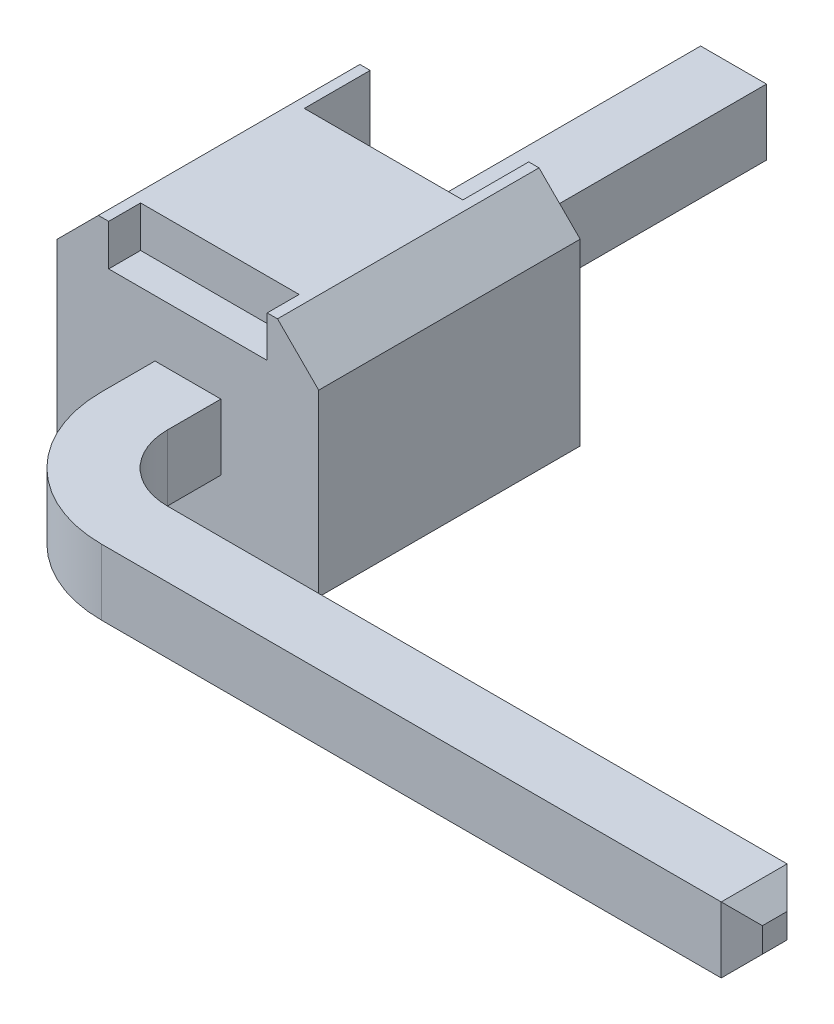
ISO-10303-21;
HEADER;
FILE_DESCRIPTION(('STEP AP214'),'2;1');
FILE_NAME('part.step','',(''),(''),'','','');
FILE_SCHEMA(('AUTOMOTIVE_DESIGN { 1 0 10303 214 1 1 1 1 }'));
ENDSEC;
DATA;
#1=APPLICATION_CONTEXT('core data for automotive mechanical design processes');
#2=APPLICATION_PROTOCOL_DEFINITION('international standard','automotive_design',2000,#1);
#3=PRODUCT_CONTEXT('',#1,'mechanical');
#4=PRODUCT('Part','Part','',(#3));
#5=PRODUCT_RELATED_PRODUCT_CATEGORY('part','',(#4));
#6=PRODUCT_DEFINITION_FORMATION('','',#4);
#7=PRODUCT_DEFINITION_CONTEXT('part definition',#1,'design');
#8=PRODUCT_DEFINITION('design','',#6,#7);
#9=PRODUCT_DEFINITION_SHAPE('','',#8);
#10=(LENGTH_UNIT() NAMED_UNIT(*) SI_UNIT(.MILLI.,.METRE.));
#11=(NAMED_UNIT(*) PLANE_ANGLE_UNIT() SI_UNIT($,.RADIAN.));
#12=(NAMED_UNIT(*) SI_UNIT($,.STERADIAN.) SOLID_ANGLE_UNIT());
#13=UNCERTAINTY_MEASURE_WITH_UNIT(LENGTH_MEASURE(1.E-05),#10,'distance_accuracy_value','');
#14=(GEOMETRIC_REPRESENTATION_CONTEXT(3) GLOBAL_UNCERTAINTY_ASSIGNED_CONTEXT((#13)) GLOBAL_UNIT_ASSIGNED_CONTEXT((#10,
#11,#12)) REPRESENTATION_CONTEXT('',''));
#15=CARTESIAN_POINT('',(0.,0.,0.));
#16=DIRECTION('',(0.,0.,1.));
#17=DIRECTION('',(1.,0.,0.));
#18=AXIS2_PLACEMENT_3D('',#15,#16,#17);
#19=CARTESIAN_POINT('',(1.27,1.27,2.96));
#20=DIRECTION('',(0.,0.,-1.));
#21=DIRECTION('',(0.,-1.,0.));
#22=AXIS2_PLACEMENT_3D('',#19,#20,#21);
#23=PLANE('',#22);
#24=DIRECTION('',(0.,-1.,0.));
#25=VECTOR('',#24,1.);
#26=CARTESIAN_POINT('',(1.27,1.27,2.96));
#27=LINE('',#26,#25);
#28=CARTESIAN_POINT('',(1.27,0.87,2.96));
#29=VERTEX_POINT('',#28);
#30=CARTESIAN_POINT('',(1.27,-0.87,2.96));
#31=VERTEX_POINT('',#30);
#32=EDGE_CURVE('P0_E199',#29,#31,#27,.T.);
#33=ORIENTED_EDGE('',*,*,#32,.T.);
#34=DIRECTION('',(-0.707106781186548,-0.707106781186548,0.));
#35=VECTOR('',#34,1.);
#36=CARTESIAN_POINT('',(1.705,-0.435,2.96));
#37=LINE('',#36,#35);
#38=CARTESIAN_POINT('',(0.87,-1.27,2.96));
#39=VERTEX_POINT('',#38);
#40=EDGE_CURVE('P0_E193',#31,#39,#37,.T.);
#41=ORIENTED_EDGE('',*,*,#40,.T.);
#42=DIRECTION('',(-1.,0.,0.));
#43=VECTOR('',#42,1.);
#44=CARTESIAN_POINT('',(1.27,-1.27,2.96));
#45=LINE('',#44,#43);
#46=CARTESIAN_POINT('',(0.77,-1.27,2.96));
#47=VERTEX_POINT('',#46);
#48=EDGE_CURVE('P0_E196',#39,#47,#45,.T.);
#49=ORIENTED_EDGE('',*,*,#48,.T.);
#50=DIRECTION('',(0.,-1.,0.));
#51=VECTOR('',#50,1.);
#52=CARTESIAN_POINT('',(0.77,1.27,2.96));
#53=LINE('',#52,#51);
#54=CARTESIAN_POINT('',(0.77,1.27,2.96));
#55=VERTEX_POINT('',#54);
#56=EDGE_CURVE('P0_E11',#55,#47,#53,.T.);
#57=ORIENTED_EDGE('',*,*,#56,.F.);
#58=DIRECTION('',(-1.,0.,0.));
#59=VECTOR('',#58,1.);
#60=CARTESIAN_POINT('',(1.27,1.27,2.96));
#61=LINE('',#60,#59);
#62=CARTESIAN_POINT('',(0.87,1.27,2.96));
#63=VERTEX_POINT('',#62);
#64=EDGE_CURVE('P0_E274',#63,#55,#61,.T.);
#65=ORIENTED_EDGE('',*,*,#64,.F.);
#66=DIRECTION('',(0.707106781186548,-0.707106781186548,0.));
#67=VECTOR('',#66,1.);
#68=CARTESIAN_POINT('',(1.07,1.07,2.96));
#69=LINE('',#68,#67);
#70=EDGE_CURVE('P0_E244',#63,#29,#69,.T.);
#71=ORIENTED_EDGE('',*,*,#70,.T.);
#72=EDGE_LOOP('',(#33,#41,#49,#57,#65,#71));
#73=FACE_BOUND('',#72,.T.);
#74=ADVANCED_FACE('P0_F16',(#73),#23,.T.);
#75=CARTESIAN_POINT('',(-0.77,0.87,5.19));
#76=DIRECTION('',(0.,0.,1.));
#77=DIRECTION('',(1.,0.,0.));
#78=AXIS2_PLACEMENT_3D('',#75,#76,#77);
#79=PLANE('',#78);
#80=DIRECTION('',(0.,1.,0.));
#81=VECTOR('',#80,1.);
#82=CARTESIAN_POINT('',(-0.77,0.87,5.19));
#83=LINE('',#82,#81);
#84=CARTESIAN_POINT('',(-0.77,0.87,5.19));
#85=VERTEX_POINT('',#84);
#86=CARTESIAN_POINT('',(-0.77,1.27,5.19));
#87=VERTEX_POINT('',#86);
#88=EDGE_CURVE('P0_E204',#85,#87,#83,.T.);
#89=ORIENTED_EDGE('',*,*,#88,.F.);
#90=DIRECTION('',(1.,0.,0.));
#91=VECTOR('',#90,1.);
#92=CARTESIAN_POINT('',(-0.77,0.87,5.19));
#93=LINE('',#92,#91);
#94=CARTESIAN_POINT('',(0.77,0.87,5.19));
#95=VERTEX_POINT('',#94);
#96=EDGE_CURVE('P0_E287',#85,#95,#93,.T.);
#97=ORIENTED_EDGE('',*,*,#96,.T.);
#98=DIRECTION('',(0.,1.,0.));
#99=VECTOR('',#98,1.);
#100=CARTESIAN_POINT('',(0.77,0.87,5.19));
#101=LINE('',#100,#99);
#102=CARTESIAN_POINT('',(0.77,1.27,5.19));
#103=VERTEX_POINT('',#102);
#104=EDGE_CURVE('P0_E242',#95,#103,#101,.T.);
#105=ORIENTED_EDGE('',*,*,#104,.T.);
#106=DIRECTION('',(1.,0.,0.));
#107=VECTOR('',#106,1.);
#108=CARTESIAN_POINT('',(-0.385,1.27,5.19));
#109=LINE('',#108,#107);
#110=EDGE_CURVE('P0_E309',#87,#103,#109,.T.);
#111=ORIENTED_EDGE('',*,*,#110,.F.);
#112=EDGE_LOOP('',(#89,#97,#105,#111));
#113=FACE_BOUND('',#112,.T.);
#114=ADVANCED_FACE('P0_F667',(#113),#79,.T.);
#115=CARTESIAN_POINT('',(0.77,1.27,2.96));
#116=DIRECTION('',(-1.,0.,0.));
#117=DIRECTION('',(0.,0.,1.));
#118=AXIS2_PLACEMENT_3D('',#115,#116,#117);
#119=PLANE('',#118);
#120=ORIENTED_EDGE('',*,*,#56,.T.);
#121=DIRECTION('',(0.,0.,1.));
#122=VECTOR('',#121,1.);
#123=CARTESIAN_POINT('',(0.77,-1.27,2.96));
#124=LINE('',#123,#122);
#125=CARTESIAN_POINT('',(0.77,-1.27,3.6));
#126=VERTEX_POINT('',#125);
#127=EDGE_CURVE('P0_E220',#47,#126,#124,.T.);
#128=ORIENTED_EDGE('',*,*,#127,.T.);
#129=DIRECTION('',(0.,-1.,0.));
#130=VECTOR('',#129,1.);
#131=CARTESIAN_POINT('',(0.77,1.27,3.6));
#132=LINE('',#131,#130);
#133=CARTESIAN_POINT('',(0.77,1.27,3.6));
#134=VERTEX_POINT('',#133);
#135=EDGE_CURVE('P0_E19',#134,#126,#132,.T.);
#136=ORIENTED_EDGE('',*,*,#135,.F.);
#137=DIRECTION('',(0.,0.,1.));
#138=VECTOR('',#137,1.);
#139=CARTESIAN_POINT('',(0.77,1.27,2.96));
#140=LINE('',#139,#138);
#141=EDGE_CURVE('P0_E301',#55,#134,#140,.T.);
#142=ORIENTED_EDGE('',*,*,#141,.F.);
#143=EDGE_LOOP('',(#120,#128,#136,#142));
#144=FACE_BOUND('',#143,.T.);
#145=ADVANCED_FACE('P0_F437',(#144),#119,.T.);
#146=CARTESIAN_POINT('',(0.77,1.27,3.6));
#147=DIRECTION('',(0.,0.,-1.));
#148=DIRECTION('',(0.,-1.,0.));
#149=AXIS2_PLACEMENT_3D('',#146,#147,#148);
#150=PLANE('',#149);
#151=DIRECTION('',(1.,0.,0.));
#152=VECTOR('',#151,1.);
#153=CARTESIAN_POINT('',(0.225,0.32,3.6));
#154=LINE('',#153,#152);
#155=CARTESIAN_POINT('',(-0.32,0.32,3.6));
#156=VERTEX_POINT('',#155);
#157=CARTESIAN_POINT('',(0.32,0.32,3.6));
#158=VERTEX_POINT('',#157);
#159=EDGE_CURVE('P0_E38',#156,#158,#154,.T.);
#160=ORIENTED_EDGE('',*,*,#159,.F.);
#161=DIRECTION('',(0.,-1.,0.));
#162=VECTOR('',#161,1.);
#163=CARTESIAN_POINT('',(-0.32,0.475,3.6));
#164=LINE('',#163,#162);
#165=CARTESIAN_POINT('',(-0.32,-0.32,3.6));
#166=VERTEX_POINT('',#165);
#167=EDGE_CURVE('P0_E310',#156,#166,#164,.T.);
#168=ORIENTED_EDGE('',*,*,#167,.T.);
#169=DIRECTION('',(1.,0.,0.));
#170=VECTOR('',#169,1.);
#171=CARTESIAN_POINT('',(0.225,-0.32,3.6));
#172=LINE('',#171,#170);
#173=CARTESIAN_POINT('',(0.32,-0.32,3.6));
#174=VERTEX_POINT('',#173);
#175=EDGE_CURVE('P0_E334',#166,#174,#172,.T.);
#176=ORIENTED_EDGE('',*,*,#175,.T.);
#177=DIRECTION('',(0.,-1.,0.));
#178=VECTOR('',#177,1.);
#179=CARTESIAN_POINT('',(0.32,0.475,3.6));
#180=LINE('',#179,#178);
#181=EDGE_CURVE('P0_E314',#158,#174,#180,.T.);
#182=ORIENTED_EDGE('',*,*,#181,.F.);
#183=EDGE_LOOP('',(#160,#168,#176,#182));
#184=FACE_BOUND('',#183,.T.);
#185=ORIENTED_EDGE('',*,*,#135,.T.);
#186=DIRECTION('',(-1.,0.,0.));
#187=VECTOR('',#186,1.);
#188=CARTESIAN_POINT('',(0.77,-1.27,3.6));
#189=LINE('',#188,#187);
#190=CARTESIAN_POINT('',(-0.77,-1.27,3.6));
#191=VERTEX_POINT('',#190);
#192=EDGE_CURVE('P0_E227',#126,#191,#189,.T.);
#193=ORIENTED_EDGE('',*,*,#192,.T.);
#194=DIRECTION('',(0.,-1.,0.));
#195=VECTOR('',#194,1.);
#196=CARTESIAN_POINT('',(-0.77,1.27,3.6));
#197=LINE('',#196,#195);
#198=CARTESIAN_POINT('',(-0.77,1.27,3.6));
#199=VERTEX_POINT('',#198);
#200=EDGE_CURVE('P0_E238',#199,#191,#197,.T.);
#201=ORIENTED_EDGE('',*,*,#200,.F.);
#202=DIRECTION('',(-1.,0.,0.));
#203=VECTOR('',#202,1.);
#204=CARTESIAN_POINT('',(0.77,1.27,3.6));
#205=LINE('',#204,#203);
#206=EDGE_CURVE('P0_E297',#134,#199,#205,.T.);
#207=ORIENTED_EDGE('',*,*,#206,.F.);
#208=EDGE_LOOP('',(#185,#193,#201,#207));
#209=FACE_BOUND('',#208,.T.);
#210=ADVANCED_FACE('P0_F433',(#184,#209),#150,.T.);
#211=CARTESIAN_POINT('',(-0.77,1.27,3.6));
#212=DIRECTION('',(1.,0.,0.));
#213=DIRECTION('',(0.,1.,0.));
#214=AXIS2_PLACEMENT_3D('',#211,#212,#213);
#215=PLANE('',#214);
#216=ORIENTED_EDGE('',*,*,#200,.T.);
#217=DIRECTION('',(0.,0.,-1.));
#218=VECTOR('',#217,1.);
#219=CARTESIAN_POINT('',(-0.77,-1.27,3.6));
#220=LINE('',#219,#218);
#221=CARTESIAN_POINT('',(-0.77,-1.27,2.96));
#222=VERTEX_POINT('',#221);
#223=EDGE_CURVE('P0_E326',#191,#222,#220,.T.);
#224=ORIENTED_EDGE('',*,*,#223,.T.);
#225=DIRECTION('',(0.,-1.,0.));
#226=VECTOR('',#225,1.);
#227=CARTESIAN_POINT('',(-0.77,1.27,2.96));
#228=LINE('',#227,#226);
#229=CARTESIAN_POINT('',(-0.77,1.27,2.96));
#230=VERTEX_POINT('',#229);
#231=EDGE_CURVE('P0_E241',#230,#222,#228,.T.);
#232=ORIENTED_EDGE('',*,*,#231,.F.);
#233=DIRECTION('',(0.,0.,-1.));
#234=VECTOR('',#233,1.);
#235=CARTESIAN_POINT('',(-0.77,1.27,3.6));
#236=LINE('',#235,#234);
#237=EDGE_CURVE('P0_E231',#199,#230,#236,.T.);
#238=ORIENTED_EDGE('',*,*,#237,.F.);
#239=EDGE_LOOP('',(#216,#224,#232,#238));
#240=FACE_BOUND('',#239,.T.);
#241=ADVANCED_FACE('P0_F436',(#240),#215,.T.);
#242=CARTESIAN_POINT('',(-0.77,1.27,2.96));
#243=DIRECTION('',(0.,0.,-1.));
#244=DIRECTION('',(0.,-1.,0.));
#245=AXIS2_PLACEMENT_3D('',#242,#243,#244);
#246=PLANE('',#245);
#247=DIRECTION('',(0.,-1.,0.));
#248=VECTOR('',#247,1.);
#249=CARTESIAN_POINT('',(-1.27,1.27,2.96));
#250=LINE('',#249,#248);
#251=CARTESIAN_POINT('',(-1.27,0.87,2.96));
#252=VERTEX_POINT('',#251);
#253=CARTESIAN_POINT('',(-1.27,-0.87,2.96));
#254=VERTEX_POINT('',#253);
#255=EDGE_CURVE('P0_E305',#252,#254,#250,.T.);
#256=ORIENTED_EDGE('',*,*,#255,.F.);
#257=DIRECTION('',(0.707106781186548,0.707106781186548,0.));
#258=VECTOR('',#257,1.);
#259=CARTESIAN_POINT('',(-0.945,1.195,2.96));
#260=LINE('',#259,#258);
#261=CARTESIAN_POINT('',(-0.87,1.27,2.96));
#262=VERTEX_POINT('',#261);
#263=EDGE_CURVE('P0_E255',#252,#262,#260,.T.);
#264=ORIENTED_EDGE('',*,*,#263,.T.);
#265=DIRECTION('',(-1.,0.,0.));
#266=VECTOR('',#265,1.);
#267=CARTESIAN_POINT('',(-0.77,1.27,2.96));
#268=LINE('',#267,#266);
#269=EDGE_CURVE('P0_E233',#230,#262,#268,.T.);
#270=ORIENTED_EDGE('',*,*,#269,.F.);
#271=ORIENTED_EDGE('',*,*,#231,.T.);
#272=DIRECTION('',(-1.,0.,0.));
#273=VECTOR('',#272,1.);
#274=CARTESIAN_POINT('',(-0.77,-1.27,2.96));
#275=LINE('',#274,#273);
#276=CARTESIAN_POINT('',(-0.87,-1.27,2.96));
#277=VERTEX_POINT('',#276);
#278=EDGE_CURVE('P0_E330',#222,#277,#275,.T.);
#279=ORIENTED_EDGE('',*,*,#278,.T.);
#280=DIRECTION('',(-0.707106781186548,0.707106781186548,0.));
#281=VECTOR('',#280,1.);
#282=CARTESIAN_POINT('',(-1.58,-0.56,2.96));
#283=LINE('',#282,#281);
#284=EDGE_CURVE('P0_E283',#277,#254,#283,.T.);
#285=ORIENTED_EDGE('',*,*,#284,.T.);
#286=EDGE_LOOP('',(#256,#264,#270,#271,#279,#285));
#287=FACE_BOUND('',#286,.T.);
#288=ADVANCED_FACE('P0_F679',(#287),#246,.T.);
#289=CARTESIAN_POINT('',(-0.32,0.32,0.));
#290=DIRECTION('',(0.,1.,0.));
#291=DIRECTION('',(1.,0.,0.));
#292=AXIS2_PLACEMENT_3D('',#289,#290,#291);
#293=PLANE('',#292);
#294=DIRECTION('',(0.,0.,1.));
#295=VECTOR('',#294,1.);
#296=CARTESIAN_POINT('',(0.32,0.32,0.));
#297=LINE('',#296,#295);
#298=CARTESIAN_POINT('',(0.32,0.32,5.5));
#299=VERTEX_POINT('',#298);
#300=EDGE_CURVE('P0_E377',#158,#299,#297,.T.);
#301=ORIENTED_EDGE('',*,*,#300,.T.);
#302=DIRECTION('',(-1.,0.,0.));
#303=VECTOR('',#302,1.);
#304=CARTESIAN_POINT('',(-0.795,0.32,5.5));
#305=LINE('',#304,#303);
#306=CARTESIAN_POINT('',(-0.32,0.32,5.5));
#307=VERTEX_POINT('',#306);
#308=EDGE_CURVE('P0_E291',#299,#307,#305,.T.);
#309=ORIENTED_EDGE('',*,*,#308,.T.);
#310=DIRECTION('',(0.,0.,1.));
#311=VECTOR('',#310,1.);
#312=CARTESIAN_POINT('',(-0.32,0.32,0.));
#313=LINE('',#312,#311);
#314=EDGE_CURVE('P0_E313',#156,#307,#313,.T.);
#315=ORIENTED_EDGE('',*,*,#314,.F.);
#316=ORIENTED_EDGE('',*,*,#159,.T.);
#317=EDGE_LOOP('',(#301,#309,#315,#316));
#318=FACE_BOUND('',#317,.T.);
#319=ADVANCED_FACE('P0_F432',(#318),#293,.F.);
#320=CARTESIAN_POINT('',(-0.32,-0.32,0.));
#321=DIRECTION('',(1.,0.,0.));
#322=DIRECTION('',(0.,1.,0.));
#323=AXIS2_PLACEMENT_3D('',#320,#321,#322);
#324=PLANE('',#323);
#325=DIRECTION('',(0.,0.,1.));
#326=VECTOR('',#325,1.);
#327=CARTESIAN_POINT('',(-0.32,-0.32,0.));
#328=LINE('',#327,#326);
#329=CARTESIAN_POINT('',(-0.32,-0.32,5.5));
#330=VERTEX_POINT('',#329);
#331=EDGE_CURVE('P0_E337',#166,#330,#328,.T.);
#332=ORIENTED_EDGE('',*,*,#331,.F.);
#333=ORIENTED_EDGE('',*,*,#167,.F.);
#334=ORIENTED_EDGE('',*,*,#314,.T.);
#335=DIRECTION('',(0.,1.,0.));
#336=VECTOR('',#335,1.);
#337=CARTESIAN_POINT('',(-0.32,0.475,5.5));
#338=LINE('',#337,#336);
#339=EDGE_CURVE('P0_E296',#330,#307,#338,.T.);
#340=ORIENTED_EDGE('',*,*,#339,.F.);
#341=EDGE_LOOP('',(#332,#333,#334,#340));
#342=FACE_BOUND('',#341,.T.);
#343=ADVANCED_FACE('P0_F430',(#342),#324,.T.);
#344=CARTESIAN_POINT('',(0.32,-0.32,0.));
#345=DIRECTION('',(1.,0.,0.));
#346=DIRECTION('',(0.,1.,0.));
#347=AXIS2_PLACEMENT_3D('',#344,#345,#346);
#348=PLANE('',#347);
#349=DIRECTION('',(0.,0.,1.));
#350=VECTOR('',#349,1.);
#351=CARTESIAN_POINT('',(0.32,-0.32,0.));
#352=LINE('',#351,#350);
#353=CARTESIAN_POINT('',(0.32,-0.32,5.5));
#354=VERTEX_POINT('',#353);
#355=EDGE_CURVE('P0_E269',#174,#354,#352,.T.);
#356=ORIENTED_EDGE('',*,*,#355,.T.);
#357=DIRECTION('',(0.,1.,0.));
#358=VECTOR('',#357,1.);
#359=CARTESIAN_POINT('',(0.32,0.475,5.5));
#360=LINE('',#359,#358);
#361=EDGE_CURVE('P0_E295',#354,#299,#360,.T.);
#362=ORIENTED_EDGE('',*,*,#361,.T.);
#363=ORIENTED_EDGE('',*,*,#300,.F.);
#364=ORIENTED_EDGE('',*,*,#181,.T.);
#365=EDGE_LOOP('',(#356,#362,#363,#364));
#366=FACE_BOUND('',#365,.T.);
#367=ADVANCED_FACE('P0_F417',(#366),#348,.F.);
#368=CARTESIAN_POINT('',(-0.32,-0.32,0.));
#369=DIRECTION('',(0.,1.,0.));
#370=DIRECTION('',(1.,0.,0.));
#371=AXIS2_PLACEMENT_3D('',#368,#369,#370);
#372=PLANE('',#371);
#373=ORIENTED_EDGE('',*,*,#355,.F.);
#374=ORIENTED_EDGE('',*,*,#175,.F.);
#375=ORIENTED_EDGE('',*,*,#331,.T.);
#376=DIRECTION('',(-1.,0.,0.));
#377=VECTOR('',#376,1.);
#378=CARTESIAN_POINT('',(-0.795,-0.32,5.5));
#379=LINE('',#378,#377);
#380=EDGE_CURVE('P0_E266',#354,#330,#379,.T.);
#381=ORIENTED_EDGE('',*,*,#380,.F.);
#382=EDGE_LOOP('',(#373,#374,#375,#381));
#383=FACE_BOUND('',#382,.T.);
#384=ADVANCED_FACE('P0_F425',(#383),#372,.T.);
#385=CARTESIAN_POINT('',(1.07,1.07,5.5));
#386=DIRECTION('',(0.707106781186548,0.707106781186548,0.));
#387=DIRECTION('',(0.,0.,-1.));
#388=AXIS2_PLACEMENT_3D('',#385,#386,#387);
#389=PLANE('',#388);
#390=DIRECTION('',(0.707106781186548,-0.707106781186548,0.));
#391=VECTOR('',#390,1.);
#392=CARTESIAN_POINT('',(0.435,1.705,5.5));
#393=LINE('',#392,#391);
#394=CARTESIAN_POINT('',(0.87,1.27,5.5));
#395=VERTEX_POINT('',#394);
#396=CARTESIAN_POINT('',(1.27,0.87,5.5));
#397=VERTEX_POINT('',#396);
#398=EDGE_CURVE('P0_E251',#395,#397,#393,.T.);
#399=ORIENTED_EDGE('',*,*,#398,.T.);
#400=DIRECTION('',(0.,0.,-1.));
#401=VECTOR('',#400,1.);
#402=CARTESIAN_POINT('',(1.27,0.87,5.5));
#403=LINE('',#402,#401);
#404=EDGE_CURVE('P0_E245',#397,#29,#403,.T.);
#405=ORIENTED_EDGE('',*,*,#404,.T.);
#406=ORIENTED_EDGE('',*,*,#70,.F.);
#407=DIRECTION('',(0.,0.,-1.));
#408=VECTOR('',#407,1.);
#409=CARTESIAN_POINT('',(0.87,1.27,5.5));
#410=LINE('',#409,#408);
#411=EDGE_CURVE('P0_E270',#395,#63,#410,.T.);
#412=ORIENTED_EDGE('',*,*,#411,.F.);
#413=EDGE_LOOP('',(#399,#405,#406,#412));
#414=FACE_BOUND('',#413,.T.);
#415=ADVANCED_FACE('P0_F455',(#414),#389,.T.);
#416=CARTESIAN_POINT('',(0.77,0.87,5.19));
#417=DIRECTION('',(1.,0.,0.));
#418=DIRECTION('',(0.,1.,0.));
#419=AXIS2_PLACEMENT_3D('',#416,#417,#418);
#420=PLANE('',#419);
#421=DIRECTION('',(0.,0.,1.));
#422=VECTOR('',#421,1.);
#423=CARTESIAN_POINT('',(0.77,0.87,5.19));
#424=LINE('',#423,#422);
#425=CARTESIAN_POINT('',(0.77,0.87,5.5));
#426=VERTEX_POINT('',#425);
#427=EDGE_CURVE('P0_E284',#95,#426,#424,.T.);
#428=ORIENTED_EDGE('',*,*,#427,.T.);
#429=DIRECTION('',(0.,1.,0.));
#430=VECTOR('',#429,1.);
#431=CARTESIAN_POINT('',(0.77,1.07,5.5));
#432=LINE('',#431,#430);
#433=CARTESIAN_POINT('',(0.77,1.27,5.5));
#434=VERTEX_POINT('',#433);
#435=EDGE_CURVE('P0_E350',#426,#434,#432,.T.);
#436=ORIENTED_EDGE('',*,*,#435,.T.);
#437=DIRECTION('',(0.,0.,-1.));
#438=VECTOR('',#437,1.);
#439=CARTESIAN_POINT('',(0.77,1.27,4.69993006993));
#440=LINE('',#439,#438);
#441=EDGE_CURVE('P0_E275',#434,#103,#440,.T.);
#442=ORIENTED_EDGE('',*,*,#441,.T.);
#443=ORIENTED_EDGE('',*,*,#104,.F.);
#444=EDGE_LOOP('',(#428,#436,#442,#443));
#445=FACE_BOUND('',#444,.T.);
#446=ADVANCED_FACE('P0_F746',(#445),#420,.F.);
#447=CARTESIAN_POINT('',(1.27,1.27,5.5));
#448=DIRECTION('',(1.,0.,0.));
#449=DIRECTION('',(0.,1.,0.));
#450=AXIS2_PLACEMENT_3D('',#447,#448,#449);
#451=PLANE('',#450);
#452=DIRECTION('',(0.,-1.,0.));
#453=VECTOR('',#452,1.);
#454=CARTESIAN_POINT('',(1.27,1.27,5.5));
#455=LINE('',#454,#453);
#456=CARTESIAN_POINT('',(1.27,-0.87,5.5));
#457=VERTEX_POINT('',#456);
#458=EDGE_CURVE('P0_E247',#397,#457,#455,.T.);
#459=ORIENTED_EDGE('',*,*,#458,.T.);
#460=DIRECTION('',(0.,0.,-1.));
#461=VECTOR('',#460,1.);
#462=CARTESIAN_POINT('',(1.27,-0.87,5.5));
#463=LINE('',#462,#461);
#464=EDGE_CURVE('P0_E203',#457,#31,#463,.T.);
#465=ORIENTED_EDGE('',*,*,#464,.T.);
#466=ORIENTED_EDGE('',*,*,#32,.F.);
#467=ORIENTED_EDGE('',*,*,#404,.F.);
#468=EDGE_LOOP('',(#459,#465,#466,#467));
#469=FACE_BOUND('',#468,.T.);
#470=ADVANCED_FACE('P0_F459',(#469),#451,.T.);
#471=CARTESIAN_POINT('',(-0.77,0.87,5.19));
#472=DIRECTION('',(0.,1.,0.));
#473=DIRECTION('',(1.,0.,0.));
#474=AXIS2_PLACEMENT_3D('',#471,#472,#473);
#475=PLANE('',#474);
#476=ORIENTED_EDGE('',*,*,#427,.F.);
#477=ORIENTED_EDGE('',*,*,#96,.F.);
#478=DIRECTION('',(0.,0.,1.));
#479=VECTOR('',#478,1.);
#480=CARTESIAN_POINT('',(-0.77,0.87,5.19));
#481=LINE('',#480,#479);
#482=CARTESIAN_POINT('',(-0.77,0.87,5.5));
#483=VERTEX_POINT('',#482);
#484=EDGE_CURVE('P0_E215',#85,#483,#481,.T.);
#485=ORIENTED_EDGE('',*,*,#484,.T.);
#486=DIRECTION('',(-1.,0.,0.));
#487=VECTOR('',#486,1.);
#488=CARTESIAN_POINT('',(-1.02,0.87,5.5));
#489=LINE('',#488,#487);
#490=EDGE_CURVE('P0_E347',#426,#483,#489,.T.);
#491=ORIENTED_EDGE('',*,*,#490,.F.);
#492=EDGE_LOOP('',(#476,#477,#485,#491));
#493=FACE_BOUND('',#492,.T.);
#494=ADVANCED_FACE('P0_F643',(#493),#475,.T.);
#495=CARTESIAN_POINT('',(1.07,-1.07,5.5));
#496=DIRECTION('',(-0.707106781186548,0.707106781186548,0.));
#497=DIRECTION('',(0.,0.,1.));
#498=AXIS2_PLACEMENT_3D('',#495,#496,#497);
#499=PLANE('',#498);
#500=DIRECTION('',(-0.707106781186548,-0.707106781186548,0.));
#501=VECTOR('',#500,1.);
#502=CARTESIAN_POINT('',(1.07,-1.07,5.5));
#503=LINE('',#502,#501);
#504=CARTESIAN_POINT('',(0.87,-1.27,5.5));
#505=VERTEX_POINT('',#504);
#506=EDGE_CURVE('P0_E210',#457,#505,#503,.T.);
#507=ORIENTED_EDGE('',*,*,#506,.T.);
#508=DIRECTION('',(0.,0.,-1.));
#509=VECTOR('',#508,1.);
#510=CARTESIAN_POINT('',(0.87,-1.27,5.5));
#511=LINE('',#510,#509);
#512=EDGE_CURVE('P0_E207',#505,#39,#511,.T.);
#513=ORIENTED_EDGE('',*,*,#512,.T.);
#514=ORIENTED_EDGE('',*,*,#40,.F.);
#515=ORIENTED_EDGE('',*,*,#464,.F.);
#516=EDGE_LOOP('',(#507,#513,#514,#515));
#517=FACE_BOUND('',#516,.T.);
#518=ADVANCED_FACE('P0_F208',(#517),#499,.F.);
#519=CARTESIAN_POINT('',(-0.77,0.87,5.19));
#520=DIRECTION('',(1.,0.,0.));
#521=DIRECTION('',(0.,1.,0.));
#522=AXIS2_PLACEMENT_3D('',#519,#520,#521);
#523=PLANE('',#522);
#524=ORIENTED_EDGE('',*,*,#484,.F.);
#525=ORIENTED_EDGE('',*,*,#88,.T.);
#526=DIRECTION('',(0.,0.,-1.));
#527=VECTOR('',#526,1.);
#528=CARTESIAN_POINT('',(-0.77,1.27,4.69993006993));
#529=LINE('',#528,#527);
#530=CARTESIAN_POINT('',(-0.77,1.27,5.5));
#531=VERTEX_POINT('',#530);
#532=EDGE_CURVE('P0_E236',#531,#87,#529,.T.);
#533=ORIENTED_EDGE('',*,*,#532,.F.);
#534=DIRECTION('',(0.,1.,0.));
#535=VECTOR('',#534,1.);
#536=CARTESIAN_POINT('',(-0.77,1.07,5.5));
#537=LINE('',#536,#535);
#538=EDGE_CURVE('P0_E262',#483,#531,#537,.T.);
#539=ORIENTED_EDGE('',*,*,#538,.F.);
#540=EDGE_LOOP('',(#524,#525,#533,#539));
#541=FACE_BOUND('',#540,.T.);
#542=ADVANCED_FACE('P0_F642',(#541),#523,.T.);
#543=CARTESIAN_POINT('',(0.,-1.27,4.20986013986));
#544=DIRECTION('',(0.,1.,0.));
#545=DIRECTION('',(0.,0.,-1.));
#546=AXIS2_PLACEMENT_3D('',#543,#544,#545);
#547=PLANE('',#546);
#548=DIRECTION('',(1.,0.,0.));
#549=VECTOR('',#548,1.);
#550=CARTESIAN_POINT('',(-1.27,-1.27,5.5));
#551=LINE('',#550,#549);
#552=CARTESIAN_POINT('',(-0.87,-1.27,5.5));
#553=VERTEX_POINT('',#552);
#554=EDGE_CURVE('P0_E354',#553,#505,#551,.T.);
#555=ORIENTED_EDGE('',*,*,#554,.F.);
#556=DIRECTION('',(0.,0.,1.));
#557=VECTOR('',#556,1.);
#558=CARTESIAN_POINT('',(-0.87,-1.27,2.96));
#559=LINE('',#558,#557);
#560=EDGE_CURVE('P0_E237',#277,#553,#559,.T.);
#561=ORIENTED_EDGE('',*,*,#560,.F.);
#562=ORIENTED_EDGE('',*,*,#278,.F.);
#563=ORIENTED_EDGE('',*,*,#223,.F.);
#564=ORIENTED_EDGE('',*,*,#192,.F.);
#565=ORIENTED_EDGE('',*,*,#127,.F.);
#566=ORIENTED_EDGE('',*,*,#48,.F.);
#567=ORIENTED_EDGE('',*,*,#512,.F.);
#568=EDGE_LOOP('',(#555,#561,#562,#563,#564,#565,#566,#567));
#569=FACE_BOUND('',#568,.T.);
#570=ADVANCED_FACE('P0_F217',(#569),#547,.F.);
#571=CARTESIAN_POINT('',(0.,1.27,4.20986013986));
#572=DIRECTION('',(0.,1.,0.));
#573=DIRECTION('',(0.,0.,-1.));
#574=AXIS2_PLACEMENT_3D('',#571,#572,#573);
#575=PLANE('',#574);
#576=ORIENTED_EDGE('',*,*,#269,.T.);
#577=DIRECTION('',(0.,0.,1.));
#578=VECTOR('',#577,1.);
#579=CARTESIAN_POINT('',(-0.87,1.27,2.96));
#580=LINE('',#579,#578);
#581=CARTESIAN_POINT('',(-0.87,1.27,5.5));
#582=VERTEX_POINT('',#581);
#583=EDGE_CURVE('P0_E280',#262,#582,#580,.T.);
#584=ORIENTED_EDGE('',*,*,#583,.T.);
#585=DIRECTION('',(1.,0.,0.));
#586=VECTOR('',#585,1.);
#587=CARTESIAN_POINT('',(-1.27,1.27,5.5));
#588=LINE('',#587,#586);
#589=EDGE_CURVE('P0_E257',#582,#531,#588,.T.);
#590=ORIENTED_EDGE('',*,*,#589,.T.);
#591=ORIENTED_EDGE('',*,*,#532,.T.);
#592=ORIENTED_EDGE('',*,*,#110,.T.);
#593=ORIENTED_EDGE('',*,*,#441,.F.);
#594=DIRECTION('',(1.,0.,0.));
#595=VECTOR('',#594,1.);
#596=CARTESIAN_POINT('',(-1.27,1.27,5.5));
#597=LINE('',#596,#595);
#598=EDGE_CURVE('P0_E279',#434,#395,#597,.T.);
#599=ORIENTED_EDGE('',*,*,#598,.T.);
#600=ORIENTED_EDGE('',*,*,#411,.T.);
#601=ORIENTED_EDGE('',*,*,#64,.T.);
#602=ORIENTED_EDGE('',*,*,#141,.T.);
#603=ORIENTED_EDGE('',*,*,#206,.T.);
#604=ORIENTED_EDGE('',*,*,#237,.T.);
#605=EDGE_LOOP('',(#576,#584,#590,#591,#592,#593,#599,#600,#601,#602,#603,#604));
#606=FACE_BOUND('',#605,.T.);
#607=ADVANCED_FACE('P0_F452',(#606),#575,.T.);
#608=CARTESIAN_POINT('',(-1.07,-1.07,2.96));
#609=DIRECTION('',(0.707106781186548,0.707106781186548,0.));
#610=DIRECTION('',(0.,0.,-1.));
#611=AXIS2_PLACEMENT_3D('',#608,#609,#610);
#612=PLANE('',#611);
#613=ORIENTED_EDGE('',*,*,#284,.F.);
#614=ORIENTED_EDGE('',*,*,#560,.T.);
#615=DIRECTION('',(-0.707106781186548,0.707106781186548,0.));
#616=VECTOR('',#615,1.);
#617=CARTESIAN_POINT('',(-1.705,-0.435,5.5));
#618=LINE('',#617,#616);
#619=CARTESIAN_POINT('',(-1.27,-0.87,5.5));
#620=VERTEX_POINT('',#619);
#621=EDGE_CURVE('P0_E351',#553,#620,#618,.T.);
#622=ORIENTED_EDGE('',*,*,#621,.T.);
#623=DIRECTION('',(0.,0.,1.));
#624=VECTOR('',#623,1.);
#625=CARTESIAN_POINT('',(-1.27,-0.87,2.96));
#626=LINE('',#625,#624);
#627=EDGE_CURVE('P0_E256',#254,#620,#626,.T.);
#628=ORIENTED_EDGE('',*,*,#627,.F.);
#629=EDGE_LOOP('',(#613,#614,#622,#628));
#630=FACE_BOUND('',#629,.T.);
#631=ADVANCED_FACE('P0_F623',(#630),#612,.F.);
#632=CARTESIAN_POINT('',(-1.07,1.07,2.96));
#633=DIRECTION('',(-0.707106781186548,0.707106781186548,0.));
#634=DIRECTION('',(0.,0.,1.));
#635=AXIS2_PLACEMENT_3D('',#632,#633,#634);
#636=PLANE('',#635);
#637=ORIENTED_EDGE('',*,*,#263,.F.);
#638=DIRECTION('',(0.,0.,1.));
#639=VECTOR('',#638,1.);
#640=CARTESIAN_POINT('',(-1.27,0.87,2.96));
#641=LINE('',#640,#639);
#642=CARTESIAN_POINT('',(-1.27,0.87,5.5));
#643=VERTEX_POINT('',#642);
#644=EDGE_CURVE('P0_E252',#252,#643,#641,.T.);
#645=ORIENTED_EDGE('',*,*,#644,.T.);
#646=DIRECTION('',(0.707106781186548,0.707106781186548,0.));
#647=VECTOR('',#646,1.);
#648=CARTESIAN_POINT('',(-1.07,1.07,5.5));
#649=LINE('',#648,#647);
#650=EDGE_CURVE('P0_E261',#643,#582,#649,.T.);
#651=ORIENTED_EDGE('',*,*,#650,.T.);
#652=ORIENTED_EDGE('',*,*,#583,.F.);
#653=EDGE_LOOP('',(#637,#645,#651,#652));
#654=FACE_BOUND('',#653,.T.);
#655=ADVANCED_FACE('P0_F629',(#654),#636,.T.);
#656=CARTESIAN_POINT('',(-1.27,1.27,2.96));
#657=DIRECTION('',(-1.,0.,0.));
#658=DIRECTION('',(0.,0.,1.));
#659=AXIS2_PLACEMENT_3D('',#656,#657,#658);
#660=PLANE('',#659);
#661=ORIENTED_EDGE('',*,*,#255,.T.);
#662=ORIENTED_EDGE('',*,*,#627,.T.);
#663=DIRECTION('',(0.,-1.,0.));
#664=VECTOR('',#663,1.);
#665=CARTESIAN_POINT('',(-1.27,1.27,5.5));
#666=LINE('',#665,#664);
#667=EDGE_CURVE('P0_E355',#643,#620,#666,.T.);
#668=ORIENTED_EDGE('',*,*,#667,.F.);
#669=ORIENTED_EDGE('',*,*,#644,.F.);
#670=EDGE_LOOP('',(#661,#662,#668,#669));
#671=FACE_BOUND('',#670,.T.);
#672=ADVANCED_FACE('P0_F703',(#671),#660,.T.);
#673=CARTESIAN_POINT('',(-1.27,1.27,5.5));
#674=DIRECTION('',(0.,0.,1.));
#675=DIRECTION('',(0.,-1.,0.));
#676=AXIS2_PLACEMENT_3D('',#673,#674,#675);
#677=PLANE('',#676);
#678=ORIENTED_EDGE('',*,*,#380,.T.);
#679=ORIENTED_EDGE('',*,*,#339,.T.);
#680=ORIENTED_EDGE('',*,*,#308,.F.);
#681=ORIENTED_EDGE('',*,*,#361,.F.);
#682=EDGE_LOOP('',(#678,#679,#680,#681));
#683=FACE_BOUND('',#682,.T.);
#684=ORIENTED_EDGE('',*,*,#667,.T.);
#685=ORIENTED_EDGE('',*,*,#621,.F.);
#686=ORIENTED_EDGE('',*,*,#554,.T.);
#687=ORIENTED_EDGE('',*,*,#506,.F.);
#688=ORIENTED_EDGE('',*,*,#458,.F.);
#689=ORIENTED_EDGE('',*,*,#398,.F.);
#690=ORIENTED_EDGE('',*,*,#598,.F.);
#691=ORIENTED_EDGE('',*,*,#435,.F.);
#692=ORIENTED_EDGE('',*,*,#490,.T.);
#693=ORIENTED_EDGE('',*,*,#538,.T.);
#694=ORIENTED_EDGE('',*,*,#589,.F.);
#695=ORIENTED_EDGE('',*,*,#650,.F.);
#696=EDGE_LOOP('',(#684,#685,#686,#687,#688,#689,#690,#691,#692,#693,#694,#695));
#697=FACE_BOUND('',#696,.T.);
#698=ADVANCED_FACE('P0_F424',(#683,#697),#677,.T.);
#699=CLOSED_SHELL('',(#74,#114,#145,#210,#241,#288,#319,#343,#367,#384,#415,#446,#470,#494,#518,
#542,#570,#607,#631,#655,#672,#698));
#700=MANIFOLD_SOLID_BREP('P0_B1',#699);
#701=CARTESIAN_POINT('',(7.08,-0.22,7.1));
#702=DIRECTION('',(-0.707106781186548,0.707106781186548,0.));
#703=DIRECTION('',(0.,0.,1.));
#704=AXIS2_PLACEMENT_3D('',#701,#702,#703);
#705=PLANE('',#704);
#706=DIRECTION('',(-0.577350269189626,-0.577350269189626,0.577350269189626));
#707=VECTOR('',#706,1.);
#708=CARTESIAN_POINT('',(7.186666666667,-0.113333333333,7.093333333333));
#709=LINE('',#708,#707);
#710=CARTESIAN_POINT('',(7.18,-0.12,7.1));
#711=VERTEX_POINT('',#710);
#712=CARTESIAN_POINT('',(6.98,-0.32,7.3));
#713=VERTEX_POINT('',#712);
#714=EDGE_CURVE('P1_E176',#711,#713,#709,.T.);
#715=ORIENTED_EDGE('',*,*,#714,.T.);
#716=DIRECTION('',(0.,0.,-1.));
#717=VECTOR('',#716,1.);
#718=CARTESIAN_POINT('',(6.98,-0.32,7.1));
#719=LINE('',#718,#717);
#720=CARTESIAN_POINT('',(6.98,-0.32,6.66));
#721=VERTEX_POINT('',#720);
#722=EDGE_CURVE('P1_E147',#713,#721,#719,.T.);
#723=ORIENTED_EDGE('',*,*,#722,.T.);
#724=DIRECTION('',(-0.577350269189626,-0.577350269189626,-0.577350269189626));
#725=VECTOR('',#724,1.);
#726=CARTESIAN_POINT('',(7.226666666667,-0.07333333333333,6.906666666667));
#727=LINE('',#726,#725);
#728=CARTESIAN_POINT('',(7.18,-0.12,6.86));
#729=VERTEX_POINT('',#728);
#730=EDGE_CURVE('P1_E11',#729,#721,#727,.T.);
#731=ORIENTED_EDGE('',*,*,#730,.F.);
#732=DIRECTION('',(0.,0.,-1.));
#733=VECTOR('',#732,1.);
#734=CARTESIAN_POINT('',(7.18,-0.12,7.1));
#735=LINE('',#734,#733);
#736=EDGE_CURVE('P1_E27',#711,#729,#735,.T.);
#737=ORIENTED_EDGE('',*,*,#736,.F.);
#738=EDGE_LOOP('',(#715,#723,#731,#737));
#739=FACE_BOUND('',#738,.T.);
#740=ADVANCED_FACE('P1_F16',(#739),#705,.F.);
#741=CARTESIAN_POINT('',(0.12,-0.22,0.1));
#742=DIRECTION('',(0.,0.707106781186548,0.707106781186548));
#743=DIRECTION('',(1.,0.,0.));
#744=AXIS2_PLACEMENT_3D('',#741,#742,#743);
#745=PLANE('',#744);
#746=DIRECTION('',(0.577350269189626,-0.577350269189626,0.577350269189626));
#747=VECTOR('',#746,1.);
#748=CARTESIAN_POINT('',(0.113333333333,-0.113333333333,-0.006666666666667));
#749=LINE('',#748,#747);
#750=CARTESIAN_POINT('',(0.12,-0.12,0.));
#751=VERTEX_POINT('',#750);
#752=CARTESIAN_POINT('',(0.32,-0.32,0.2));
#753=VERTEX_POINT('',#752);
#754=EDGE_CURVE('P1_E141',#751,#753,#749,.T.);
#755=ORIENTED_EDGE('',*,*,#754,.T.);
#756=DIRECTION('',(-1.,0.,0.));
#757=VECTOR('',#756,1.);
#758=CARTESIAN_POINT('',(0.12,-0.32,0.2));
#759=LINE('',#758,#757);
#760=CARTESIAN_POINT('',(-0.32,-0.32,0.2));
#761=VERTEX_POINT('',#760);
#762=EDGE_CURVE('P1_E134',#753,#761,#759,.T.);
#763=ORIENTED_EDGE('',*,*,#762,.T.);
#764=DIRECTION('',(-0.577350269189626,-0.577350269189626,0.577350269189626));
#765=VECTOR('',#764,1.);
#766=CARTESIAN_POINT('',(-0.07333333333333,-0.07333333333333,-0.04666666666667));
#767=LINE('',#766,#765);
#768=CARTESIAN_POINT('',(-0.12,-0.12,0.));
#769=VERTEX_POINT('',#768);
#770=EDGE_CURVE('P1_E138',#769,#761,#767,.T.);
#771=ORIENTED_EDGE('',*,*,#770,.F.);
#772=DIRECTION('',(-1.,0.,0.));
#773=VECTOR('',#772,1.);
#774=CARTESIAN_POINT('',(0.12,-0.12,0.));
#775=LINE('',#774,#773);
#776=EDGE_CURVE('P1_E235',#751,#769,#775,.T.);
#777=ORIENTED_EDGE('',*,*,#776,.F.);
#778=EDGE_LOOP('',(#755,#763,#771,#777));
#779=FACE_BOUND('',#778,.T.);
#780=ADVANCED_FACE('P1_F136',(#779),#745,.F.);
#781=CARTESIAN_POINT('',(7.08,0.32,6.76));
#782=DIRECTION('',(0.707106781186548,0.,-0.707106781186548));
#783=DIRECTION('',(0.,-1.,0.));
#784=AXIS2_PLACEMENT_3D('',#781,#782,#783);
#785=PLANE('',#784);
#786=DIRECTION('',(0.,-1.,0.));
#787=VECTOR('',#786,1.);
#788=CARTESIAN_POINT('',(7.18,0.32,6.86));
#789=LINE('',#788,#787);
#790=CARTESIAN_POINT('',(7.18,0.12,6.86));
#791=VERTEX_POINT('',#790);
#792=EDGE_CURVE('P1_E203',#791,#729,#789,.T.);
#793=ORIENTED_EDGE('',*,*,#792,.T.);
#794=ORIENTED_EDGE('',*,*,#730,.T.);
#795=DIRECTION('',(0.,-1.,0.));
#796=VECTOR('',#795,1.);
#797=CARTESIAN_POINT('',(6.98,0.32,6.66));
#798=LINE('',#797,#796);
#799=CARTESIAN_POINT('',(6.98,0.32,6.66));
#800=VERTEX_POINT('',#799);
#801=EDGE_CURVE('P1_E183',#800,#721,#798,.T.);
#802=ORIENTED_EDGE('',*,*,#801,.F.);
#803=DIRECTION('',(-0.577350269189626,0.577350269189626,-0.577350269189626));
#804=VECTOR('',#803,1.);
#805=CARTESIAN_POINT('',(7.12,0.18,6.8));
#806=LINE('',#805,#804);
#807=EDGE_CURVE('P1_E197',#791,#800,#806,.T.);
#808=ORIENTED_EDGE('',*,*,#807,.F.);
#809=EDGE_LOOP('',(#793,#794,#802,#808));
#810=FACE_BOUND('',#809,.T.);
#811=ADVANCED_FACE('P1_F316',(#810),#785,.T.);
#812=CARTESIAN_POINT('',(7.18,0.32,7.3));
#813=DIRECTION('',(1.,0.,0.));
#814=DIRECTION('',(0.,1.,0.));
#815=AXIS2_PLACEMENT_3D('',#812,#813,#814);
#816=PLANE('',#815);
#817=ORIENTED_EDGE('',*,*,#792,.F.);
#818=DIRECTION('',(0.,0.,-1.));
#819=VECTOR('',#818,1.);
#820=CARTESIAN_POINT('',(7.18,0.12,7.1));
#821=LINE('',#820,#819);
#822=CARTESIAN_POINT('',(7.18,0.12,7.1));
#823=VERTEX_POINT('',#822);
#824=EDGE_CURVE('P1_E220',#823,#791,#821,.T.);
#825=ORIENTED_EDGE('',*,*,#824,.F.);
#826=DIRECTION('',(0.,-1.,0.));
#827=VECTOR('',#826,1.);
#828=CARTESIAN_POINT('',(7.18,0.32,7.1));
#829=LINE('',#828,#827);
#830=EDGE_CURVE('P1_E232',#823,#711,#829,.T.);
#831=ORIENTED_EDGE('',*,*,#830,.T.);
#832=ORIENTED_EDGE('',*,*,#736,.T.);
#833=EDGE_LOOP('',(#817,#825,#831,#832));
#834=FACE_BOUND('',#833,.T.);
#835=ADVANCED_FACE('P1_F326',(#834),#816,.T.);
#836=CARTESIAN_POINT('',(7.08,0.32,7.2));
#837=DIRECTION('',(0.707106781186548,0.,0.707106781186548));
#838=DIRECTION('',(0.,-1.,0.));
#839=AXIS2_PLACEMENT_3D('',#836,#837,#838);
#840=PLANE('',#839);
#841=ORIENTED_EDGE('',*,*,#830,.F.);
#842=DIRECTION('',(-0.577350269189626,0.577350269189626,0.577350269189626));
#843=VECTOR('',#842,1.);
#844=CARTESIAN_POINT('',(7.08,0.22,7.2));
#845=LINE('',#844,#843);
#846=CARTESIAN_POINT('',(6.98,0.32,7.3));
#847=VERTEX_POINT('',#846);
#848=EDGE_CURVE('P1_E254',#823,#847,#845,.T.);
#849=ORIENTED_EDGE('',*,*,#848,.T.);
#850=DIRECTION('',(0.,-1.,0.));
#851=VECTOR('',#850,1.);
#852=CARTESIAN_POINT('',(6.98,0.32,7.3));
#853=LINE('',#852,#851);
#854=EDGE_CURVE('P1_E216',#847,#713,#853,.T.);
#855=ORIENTED_EDGE('',*,*,#854,.T.);
#856=ORIENTED_EDGE('',*,*,#714,.F.);
#857=EDGE_LOOP('',(#841,#849,#855,#856));
#858=FACE_BOUND('',#857,.T.);
#859=ADVANCED_FACE('P1_F331',(#858),#840,.T.);
#860=CARTESIAN_POINT('',(0.32,0.32,0.));
#861=DIRECTION('',(0.,0.,-1.));
#862=DIRECTION('',(0.,-1.,0.));
#863=AXIS2_PLACEMENT_3D('',#860,#861,#862);
#864=PLANE('',#863);
#865=DIRECTION('',(0.,-1.,0.));
#866=VECTOR('',#865,1.);
#867=CARTESIAN_POINT('',(0.12,0.32,0.));
#868=LINE('',#867,#866);
#869=CARTESIAN_POINT('',(0.12,0.12,0.));
#870=VERTEX_POINT('',#869);
#871=EDGE_CURVE('P1_E184',#870,#751,#868,.T.);
#872=ORIENTED_EDGE('',*,*,#871,.T.);
#873=ORIENTED_EDGE('',*,*,#776,.T.);
#874=DIRECTION('',(0.,-1.,0.));
#875=VECTOR('',#874,1.);
#876=CARTESIAN_POINT('',(-0.12,0.32,0.));
#877=LINE('',#876,#875);
#878=CARTESIAN_POINT('',(-0.12,0.12,0.));
#879=VERTEX_POINT('',#878);
#880=EDGE_CURVE('P1_E154',#879,#769,#877,.T.);
#881=ORIENTED_EDGE('',*,*,#880,.F.);
#882=DIRECTION('',(-1.,0.,0.));
#883=VECTOR('',#882,1.);
#884=CARTESIAN_POINT('',(0.12,0.12,0.));
#885=LINE('',#884,#883);
#886=EDGE_CURVE('P1_E20',#870,#879,#885,.T.);
#887=ORIENTED_EDGE('',*,*,#886,.F.);
#888=EDGE_LOOP('',(#872,#873,#881,#887));
#889=FACE_BOUND('',#888,.T.);
#890=ADVANCED_FACE('P1_F301',(#889),#864,.T.);
#891=CARTESIAN_POINT('',(0.22,0.32,0.1));
#892=DIRECTION('',(0.707106781186548,0.,-0.707106781186548));
#893=DIRECTION('',(0.,-1.,0.));
#894=AXIS2_PLACEMENT_3D('',#891,#892,#893);
#895=PLANE('',#894);
#896=ORIENTED_EDGE('',*,*,#871,.F.);
#897=DIRECTION('',(0.577350269189626,0.577350269189626,0.577350269189626));
#898=VECTOR('',#897,1.);
#899=CARTESIAN_POINT('',(0.22,0.22,0.1));
#900=LINE('',#899,#898);
#901=CARTESIAN_POINT('',(0.32,0.32,0.2));
#902=VERTEX_POINT('',#901);
#903=EDGE_CURVE('P1_E250',#870,#902,#900,.T.);
#904=ORIENTED_EDGE('',*,*,#903,.T.);
#905=DIRECTION('',(0.,-1.,0.));
#906=VECTOR('',#905,1.);
#907=CARTESIAN_POINT('',(0.32,0.32,0.2));
#908=LINE('',#907,#906);
#909=EDGE_CURVE('P1_E251',#902,#753,#908,.T.);
#910=ORIENTED_EDGE('',*,*,#909,.T.);
#911=ORIENTED_EDGE('',*,*,#754,.F.);
#912=EDGE_LOOP('',(#896,#904,#910,#911));
#913=FACE_BOUND('',#912,.T.);
#914=ADVANCED_FACE('P1_F304',(#913),#895,.T.);
#915=CARTESIAN_POINT('',(1.8865,-0.32,5.1935));
#916=DIRECTION('',(0.,1.,0.));
#917=DIRECTION('',(0.,0.,-1.));
#918=AXIS2_PLACEMENT_3D('',#915,#916,#917);
#919=PLANE('',#918);
#920=DIRECTION('',(0.,0.,1.));
#921=VECTOR('',#920,1.);
#922=CARTESIAN_POINT('',(-0.32,-0.32,0.));
#923=LINE('',#922,#921);
#924=CARTESIAN_POINT('',(-0.32,-0.32,6.02));
#925=VERTEX_POINT('',#924);
#926=EDGE_CURVE('P1_E157',#761,#925,#923,.T.);
#927=ORIENTED_EDGE('',*,*,#926,.F.);
#928=ORIENTED_EDGE('',*,*,#762,.F.);
#929=DIRECTION('',(0.,0.,-1.));
#930=VECTOR('',#929,1.);
#931=CARTESIAN_POINT('',(0.32,-0.32,6.66));
#932=LINE('',#931,#930);
#933=CARTESIAN_POINT('',(0.32,-0.32,6.02));
#934=VERTEX_POINT('',#933);
#935=EDGE_CURVE('P1_E255',#934,#753,#932,.T.);
#936=ORIENTED_EDGE('',*,*,#935,.F.);
#937=CARTESIAN_POINT('',(0.96,-0.32,6.02));
#938=DIRECTION('',(0.,1.,0.));
#939=DIRECTION('',(0.,0.,-1.));
#940=AXIS2_PLACEMENT_3D('',#937,#938,#939);
#941=CIRCLE('',#940,0.64);
#942=CARTESIAN_POINT('',(0.96,-0.32,6.66));
#943=VERTEX_POINT('',#942);
#944=EDGE_CURVE('P1_E196',#934,#943,#941,.T.);
#945=ORIENTED_EDGE('',*,*,#944,.T.);
#946=DIRECTION('',(-1.,0.,0.));
#947=VECTOR('',#946,1.);
#948=CARTESIAN_POINT('',(7.18,-0.32,6.66));
#949=LINE('',#948,#947);
#950=EDGE_CURVE('P1_E180',#721,#943,#949,.T.);
#951=ORIENTED_EDGE('',*,*,#950,.F.);
#952=ORIENTED_EDGE('',*,*,#722,.F.);
#953=DIRECTION('',(1.,0.,0.));
#954=VECTOR('',#953,1.);
#955=CARTESIAN_POINT('',(-0.32,-0.32,7.3));
#956=LINE('',#955,#954);
#957=CARTESIAN_POINT('',(0.96,-0.32,7.3));
#958=VERTEX_POINT('',#957);
#959=EDGE_CURVE('P1_E212',#958,#713,#956,.T.);
#960=ORIENTED_EDGE('',*,*,#959,.F.);
#961=CARTESIAN_POINT('',(0.96,-0.32,6.02));
#962=DIRECTION('',(0.,1.,0.));
#963=DIRECTION('',(0.,0.,-1.));
#964=AXIS2_PLACEMENT_3D('',#961,#962,#963);
#965=CIRCLE('',#964,1.28);
#966=EDGE_CURVE('P1_E160',#925,#958,#965,.T.);
#967=ORIENTED_EDGE('',*,*,#966,.F.);
#968=EDGE_LOOP('',(#927,#928,#936,#945,#951,#952,#960,#967));
#969=FACE_BOUND('',#968,.T.);
#970=ADVANCED_FACE('P1_F158',(#969),#919,.F.);
#971=CARTESIAN_POINT('',(-0.22,0.32,0.1));
#972=DIRECTION('',(-0.707106781186548,0.,-0.707106781186548));
#973=DIRECTION('',(-0.707106781186548,0.,0.707106781186548));
#974=AXIS2_PLACEMENT_3D('',#971,#972,#973);
#975=PLANE('',#974);
#976=ORIENTED_EDGE('',*,*,#880,.T.);
#977=ORIENTED_EDGE('',*,*,#770,.T.);
#978=DIRECTION('',(0.,-1.,0.));
#979=VECTOR('',#978,1.);
#980=CARTESIAN_POINT('',(-0.32,0.32,0.2));
#981=LINE('',#980,#979);
#982=CARTESIAN_POINT('',(-0.32,0.32,0.2));
#983=VERTEX_POINT('',#982);
#984=EDGE_CURVE('P1_E152',#983,#761,#981,.T.);
#985=ORIENTED_EDGE('',*,*,#984,.F.);
#986=DIRECTION('',(-0.577350269189626,0.577350269189626,0.577350269189626));
#987=VECTOR('',#986,1.);
#988=CARTESIAN_POINT('',(-0.18,0.18,0.06));
#989=LINE('',#988,#987);
#990=EDGE_CURVE('P1_E104',#879,#983,#989,.T.);
#991=ORIENTED_EDGE('',*,*,#990,.F.);
#992=EDGE_LOOP('',(#976,#977,#985,#991));
#993=FACE_BOUND('',#992,.T.);
#994=ADVANCED_FACE('P1_F150',(#993),#975,.T.);
#995=CARTESIAN_POINT('',(7.18,0.32,6.66));
#996=DIRECTION('',(0.,0.,-1.));
#997=DIRECTION('',(0.,-1.,0.));
#998=AXIS2_PLACEMENT_3D('',#995,#996,#997);
#999=PLANE('',#998);
#1000=DIRECTION('',(-1.,0.,0.));
#1001=VECTOR('',#1000,1.);
#1002=CARTESIAN_POINT('',(7.18,0.32,6.66));
#1003=LINE('',#1002,#1001);
#1004=CARTESIAN_POINT('',(0.96,0.32,6.66));
#1005=VERTEX_POINT('',#1004);
#1006=EDGE_CURVE('P1_E227',#800,#1005,#1003,.T.);
#1007=ORIENTED_EDGE('',*,*,#1006,.F.);
#1008=ORIENTED_EDGE('',*,*,#801,.T.);
#1009=ORIENTED_EDGE('',*,*,#950,.T.);
#1010=DIRECTION('',(0.,-1.,0.));
#1011=VECTOR('',#1010,1.);
#1012=CARTESIAN_POINT('',(0.96,0.32,6.66));
#1013=LINE('',#1012,#1011);
#1014=EDGE_CURVE('P1_E192',#1005,#943,#1013,.T.);
#1015=ORIENTED_EDGE('',*,*,#1014,.F.);
#1016=EDGE_LOOP('',(#1007,#1008,#1009,#1015));
#1017=FACE_BOUND('',#1016,.T.);
#1018=ADVANCED_FACE('P1_F312',(#1017),#999,.T.);
#1019=CARTESIAN_POINT('',(0.96,0.32,6.02));
#1020=DIRECTION('',(0.,-1.,0.));
#1021=DIRECTION('',(-1.,0.,0.));
#1022=AXIS2_PLACEMENT_3D('',#1019,#1020,#1021);
#1023=CYLINDRICAL_SURFACE('',#1022,0.64);
#1024=CARTESIAN_POINT('',(0.96,0.32,6.02));
#1025=DIRECTION('',(0.,1.,0.));
#1026=DIRECTION('',(0.,0.,-1.));
#1027=AXIS2_PLACEMENT_3D('',#1024,#1025,#1026);
#1028=CIRCLE('',#1027,0.64);
#1029=CARTESIAN_POINT('',(0.32,0.32,6.02));
#1030=VERTEX_POINT('',#1029);
#1031=EDGE_CURVE('P1_E191',#1030,#1005,#1028,.T.);
#1032=ORIENTED_EDGE('',*,*,#1031,.T.);
#1033=ORIENTED_EDGE('',*,*,#1014,.T.);
#1034=ORIENTED_EDGE('',*,*,#944,.F.);
#1035=DIRECTION('',(0.,-1.,0.));
#1036=VECTOR('',#1035,1.);
#1037=CARTESIAN_POINT('',(0.32,0.32,6.02));
#1038=LINE('',#1037,#1036);
#1039=EDGE_CURVE('P1_E246',#1030,#934,#1038,.T.);
#1040=ORIENTED_EDGE('',*,*,#1039,.F.);
#1041=EDGE_LOOP('',(#1032,#1033,#1034,#1040));
#1042=FACE_BOUND('',#1041,.T.);
#1043=ADVANCED_FACE('P1_F310',(#1042),#1023,.F.);
#1044=CARTESIAN_POINT('',(7.08,0.22,7.1));
#1045=DIRECTION('',(0.707106781186548,0.707106781186548,0.));
#1046=DIRECTION('',(0.,0.,-1.));
#1047=AXIS2_PLACEMENT_3D('',#1044,#1045,#1046);
#1048=PLANE('',#1047);
#1049=ORIENTED_EDGE('',*,*,#848,.F.);
#1050=ORIENTED_EDGE('',*,*,#824,.T.);
#1051=ORIENTED_EDGE('',*,*,#807,.T.);
#1052=DIRECTION('',(0.,0.,-1.));
#1053=VECTOR('',#1052,1.);
#1054=CARTESIAN_POINT('',(6.98,0.32,7.1));
#1055=LINE('',#1054,#1053);
#1056=EDGE_CURVE('P1_E223',#847,#800,#1055,.T.);
#1057=ORIENTED_EDGE('',*,*,#1056,.F.);
#1058=EDGE_LOOP('',(#1049,#1050,#1051,#1057));
#1059=FACE_BOUND('',#1058,.T.);
#1060=ADVANCED_FACE('P1_F320',(#1059),#1048,.T.);
#1061=CARTESIAN_POINT('',(0.32,0.32,6.66));
#1062=DIRECTION('',(1.,0.,0.));
#1063=DIRECTION('',(0.,1.,0.));
#1064=AXIS2_PLACEMENT_3D('',#1061,#1062,#1063);
#1065=PLANE('',#1064);
#1066=DIRECTION('',(0.,0.,-1.));
#1067=VECTOR('',#1066,1.);
#1068=CARTESIAN_POINT('',(0.32,0.32,6.66));
#1069=LINE('',#1068,#1067);
#1070=EDGE_CURVE('P1_E172',#1030,#902,#1069,.T.);
#1071=ORIENTED_EDGE('',*,*,#1070,.F.);
#1072=ORIENTED_EDGE('',*,*,#1039,.T.);
#1073=ORIENTED_EDGE('',*,*,#935,.T.);
#1074=ORIENTED_EDGE('',*,*,#909,.F.);
#1075=EDGE_LOOP('',(#1071,#1072,#1073,#1074));
#1076=FACE_BOUND('',#1075,.T.);
#1077=ADVANCED_FACE('P1_F307',(#1076),#1065,.T.);
#1078=CARTESIAN_POINT('',(-0.32,0.32,7.3));
#1079=DIRECTION('',(0.,0.,1.));
#1080=DIRECTION('',(0.,-1.,0.));
#1081=AXIS2_PLACEMENT_3D('',#1078,#1079,#1080);
#1082=PLANE('',#1081);
#1083=DIRECTION('',(1.,0.,0.));
#1084=VECTOR('',#1083,1.);
#1085=CARTESIAN_POINT('',(-0.32,0.32,7.3));
#1086=LINE('',#1085,#1084);
#1087=CARTESIAN_POINT('',(0.96,0.32,7.3));
#1088=VERTEX_POINT('',#1087);
#1089=EDGE_CURVE('P1_E228',#1088,#847,#1086,.T.);
#1090=ORIENTED_EDGE('',*,*,#1089,.F.);
#1091=DIRECTION('',(0.,-1.,0.));
#1092=VECTOR('',#1091,1.);
#1093=CARTESIAN_POINT('',(0.96,0.32,7.3));
#1094=LINE('',#1093,#1092);
#1095=EDGE_CURVE('P1_E179',#1088,#958,#1094,.T.);
#1096=ORIENTED_EDGE('',*,*,#1095,.T.);
#1097=ORIENTED_EDGE('',*,*,#959,.T.);
#1098=ORIENTED_EDGE('',*,*,#854,.F.);
#1099=EDGE_LOOP('',(#1090,#1096,#1097,#1098));
#1100=FACE_BOUND('',#1099,.T.);
#1101=ADVANCED_FACE('P1_F481',(#1100),#1082,.T.);
#1102=CARTESIAN_POINT('',(0.12,0.22,0.1));
#1103=DIRECTION('',(0.,0.707106781186548,-0.707106781186548));
#1104=DIRECTION('',(-1.,0.,0.));
#1105=AXIS2_PLACEMENT_3D('',#1102,#1103,#1104);
#1106=PLANE('',#1105);
#1107=ORIENTED_EDGE('',*,*,#903,.F.);
#1108=ORIENTED_EDGE('',*,*,#886,.T.);
#1109=ORIENTED_EDGE('',*,*,#990,.T.);
#1110=DIRECTION('',(-1.,0.,0.));
#1111=VECTOR('',#1110,1.);
#1112=CARTESIAN_POINT('',(0.12,0.32,0.2));
#1113=LINE('',#1112,#1111);
#1114=EDGE_CURVE('P1_E166',#902,#983,#1113,.T.);
#1115=ORIENTED_EDGE('',*,*,#1114,.F.);
#1116=EDGE_LOOP('',(#1107,#1108,#1109,#1115));
#1117=FACE_BOUND('',#1116,.T.);
#1118=ADVANCED_FACE('P1_F299',(#1117),#1106,.T.);
#1119=CARTESIAN_POINT('',(0.96,0.32,6.02));
#1120=DIRECTION('',(0.,-1.,0.));
#1121=DIRECTION('',(-1.,0.,0.));
#1122=AXIS2_PLACEMENT_3D('',#1119,#1120,#1121);
#1123=CYLINDRICAL_SURFACE('',#1122,1.28);
#1124=CARTESIAN_POINT('',(0.96,0.32,6.02));
#1125=DIRECTION('',(0.,1.,0.));
#1126=DIRECTION('',(0.,0.,-1.));
#1127=AXIS2_PLACEMENT_3D('',#1124,#1125,#1126);
#1128=CIRCLE('',#1127,1.28);
#1129=CARTESIAN_POINT('',(-0.32,0.32,6.02));
#1130=VERTEX_POINT('',#1129);
#1131=EDGE_CURVE('P1_E210',#1130,#1088,#1128,.T.);
#1132=ORIENTED_EDGE('',*,*,#1131,.F.);
#1133=DIRECTION('',(0.,-1.,0.));
#1134=VECTOR('',#1133,1.);
#1135=CARTESIAN_POINT('',(-0.32,0.32,6.02));
#1136=LINE('',#1135,#1134);
#1137=EDGE_CURVE('P1_E89',#1130,#925,#1136,.T.);
#1138=ORIENTED_EDGE('',*,*,#1137,.T.);
#1139=ORIENTED_EDGE('',*,*,#966,.T.);
#1140=ORIENTED_EDGE('',*,*,#1095,.F.);
#1141=EDGE_LOOP('',(#1132,#1138,#1139,#1140));
#1142=FACE_BOUND('',#1141,.T.);
#1143=ADVANCED_FACE('P1_F460',(#1142),#1123,.T.);
#1144=CARTESIAN_POINT('',(-0.32,0.32,0.));
#1145=DIRECTION('',(-1.,0.,0.));
#1146=DIRECTION('',(0.,0.,1.));
#1147=AXIS2_PLACEMENT_3D('',#1144,#1145,#1146);
#1148=PLANE('',#1147);
#1149=DIRECTION('',(0.,0.,1.));
#1150=VECTOR('',#1149,1.);
#1151=CARTESIAN_POINT('',(-0.32,0.32,0.));
#1152=LINE('',#1151,#1150);
#1153=EDGE_CURVE('P1_E164',#983,#1130,#1152,.T.);
#1154=ORIENTED_EDGE('',*,*,#1153,.F.);
#1155=ORIENTED_EDGE('',*,*,#984,.T.);
#1156=ORIENTED_EDGE('',*,*,#926,.T.);
#1157=ORIENTED_EDGE('',*,*,#1137,.F.);
#1158=EDGE_LOOP('',(#1154,#1155,#1156,#1157));
#1159=FACE_BOUND('',#1158,.T.);
#1160=ADVANCED_FACE('P1_F18',(#1159),#1148,.T.);
#1161=CARTESIAN_POINT('',(1.8865,0.32,5.1935));
#1162=DIRECTION('',(0.,1.,0.));
#1163=DIRECTION('',(0.,0.,-1.));
#1164=AXIS2_PLACEMENT_3D('',#1161,#1162,#1163);
#1165=PLANE('',#1164);
#1166=ORIENTED_EDGE('',*,*,#1153,.T.);
#1167=ORIENTED_EDGE('',*,*,#1131,.T.);
#1168=ORIENTED_EDGE('',*,*,#1089,.T.);
#1169=ORIENTED_EDGE('',*,*,#1056,.T.);
#1170=ORIENTED_EDGE('',*,*,#1006,.T.);
#1171=ORIENTED_EDGE('',*,*,#1031,.F.);
#1172=ORIENTED_EDGE('',*,*,#1070,.T.);
#1173=ORIENTED_EDGE('',*,*,#1114,.T.);
#1174=EDGE_LOOP('',(#1166,#1167,#1168,#1169,#1170,#1171,#1172,#1173));
#1175=FACE_BOUND('',#1174,.T.);
#1176=ADVANCED_FACE('P1_F431',(#1175),#1165,.T.);
#1177=CLOSED_SHELL('',(#740,#780,#811,#835,#859,#890,#914,#970,#994,#1018,#1043,#1060,#1077,
#1101,#1118,#1143,#1160,#1176));
#1178=MANIFOLD_SOLID_BREP('P1_B1',#1177);
#1179=ADVANCED_BREP_SHAPE_REPRESENTATION('',(#18,#700,#1178),#14);
#1180=SHAPE_DEFINITION_REPRESENTATION(#9,#1179);
ENDSEC;
END-ISO-10303-21;
